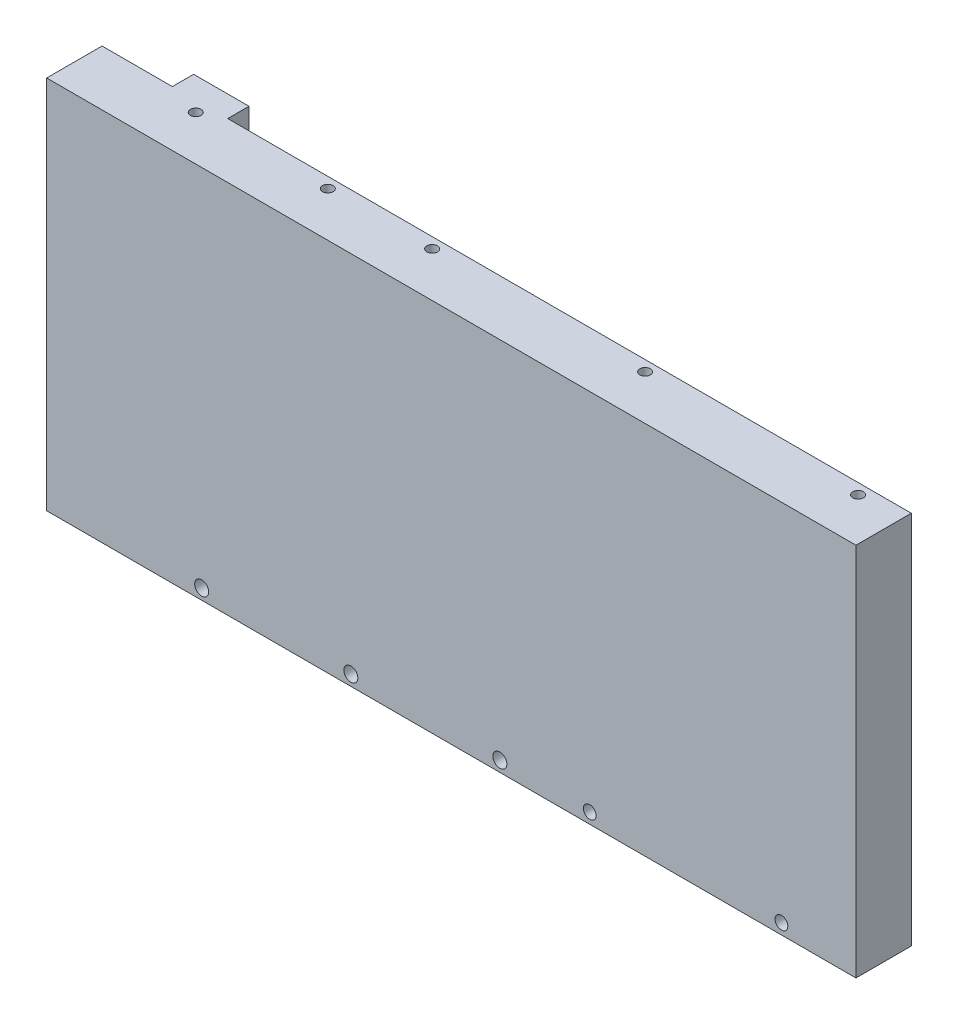
ISO-10303-21;
HEADER;
FILE_DESCRIPTION(('STEP AP214'),'2;1');
FILE_NAME('part.step','',(''),(''),'','','');
FILE_SCHEMA(('AUTOMOTIVE_DESIGN { 1 0 10303 214 1 1 1 1 }'));
ENDSEC;
DATA;
#1=APPLICATION_CONTEXT('core data for automotive mechanical design processes');
#2=APPLICATION_PROTOCOL_DEFINITION('international standard','automotive_design',2000,#1);
#3=PRODUCT_CONTEXT('',#1,'mechanical');
#4=PRODUCT('Part','Part','',(#3));
#5=PRODUCT_RELATED_PRODUCT_CATEGORY('part','',(#4));
#6=PRODUCT_DEFINITION_FORMATION('','',#4);
#7=PRODUCT_DEFINITION_CONTEXT('part definition',#1,'design');
#8=PRODUCT_DEFINITION('design','',#6,#7);
#9=PRODUCT_DEFINITION_SHAPE('','',#8);
#10=(LENGTH_UNIT() NAMED_UNIT(*) SI_UNIT(.MILLI.,.METRE.));
#11=(NAMED_UNIT(*) PLANE_ANGLE_UNIT() SI_UNIT($,.RADIAN.));
#12=(NAMED_UNIT(*) SI_UNIT($,.STERADIAN.) SOLID_ANGLE_UNIT());
#13=UNCERTAINTY_MEASURE_WITH_UNIT(LENGTH_MEASURE(1.E-05),#10,'distance_accuracy_value','');
#14=(GEOMETRIC_REPRESENTATION_CONTEXT(3) GLOBAL_UNCERTAINTY_ASSIGNED_CONTEXT((#13)) GLOBAL_UNIT_ASSIGNED_CONTEXT((#10,
#11,#12)) REPRESENTATION_CONTEXT('',''));
#15=CARTESIAN_POINT('',(0.,0.,0.));
#16=DIRECTION('',(0.,0.,1.));
#17=DIRECTION('',(1.,0.,0.));
#18=AXIS2_PLACEMENT_3D('',#15,#16,#17);
#19=CARTESIAN_POINT('',(0.,0.,0.));
#20=DIRECTION('',(0.,0.,1.));
#21=DIRECTION('',(1.,0.,0.));
#22=AXIS2_PLACEMENT_3D('',#19,#20,#21);
#23=PLANE('',#22);
#24=DIRECTION('',(0.,-1.,0.));
#25=VECTOR('',#24,1.);
#26=CARTESIAN_POINT('',(-43.5,0.,0.));
#27=LINE('',#26,#25);
#28=CARTESIAN_POINT('',(-43.5,29.,0.));
#29=VERTEX_POINT('',#28);
#30=CARTESIAN_POINT('',(-43.5,3.99999999999999,0.));
#31=VERTEX_POINT('',#30);
#32=EDGE_CURVE('E372',#29,#31,#27,.T.);
#33=ORIENTED_EDGE('',*,*,#32,.T.);
#34=CARTESIAN_POINT('',(-36.5,3.99999999999999,0.));
#35=DIRECTION('',(0.,0.,1.));
#36=DIRECTION('',(1.,0.,0.));
#37=AXIS2_PLACEMENT_3D('',#34,#35,#36);
#38=CIRCLE('',#37,6.99999999999999);
#39=CARTESIAN_POINT('',(-29.5,3.99999999999999,0.));
#40=VERTEX_POINT('',#39);
#41=EDGE_CURVE('E11',#31,#40,#38,.T.);
#42=ORIENTED_EDGE('',*,*,#41,.T.);
#43=DIRECTION('',(0.,1.,0.));
#44=VECTOR('',#43,1.);
#45=CARTESIAN_POINT('',(-29.5,0.,0.));
#46=LINE('',#45,#44);
#47=CARTESIAN_POINT('',(-29.5,29.,0.));
#48=VERTEX_POINT('',#47);
#49=EDGE_CURVE('E49',#40,#48,#46,.T.);
#50=ORIENTED_EDGE('',*,*,#49,.T.);
#51=CARTESIAN_POINT('',(-36.5,29.,0.));
#52=DIRECTION('',(0.,0.,1.));
#53=DIRECTION('',(1.,0.,0.));
#54=AXIS2_PLACEMENT_3D('',#51,#52,#53);
#55=CIRCLE('',#54,7.);
#56=EDGE_CURVE('E209',#48,#29,#55,.T.);
#57=ORIENTED_EDGE('',*,*,#56,.T.);
#58=EDGE_LOOP('',(#33,#42,#50,#57));
#59=FACE_BOUND('',#58,.T.);
#60=CARTESIAN_POINT('',(-58.6,-41.5,0.));
#61=DIRECTION('',(0.,0.,1.));
#62=DIRECTION('',(1.,0.,0.));
#63=AXIS2_PLACEMENT_3D('',#60,#61,#62);
#64=CIRCLE('',#63,1.65);
#65=CARTESIAN_POINT('',(-56.95,-41.5,0.));
#66=VERTEX_POINT('',#65);
#67=EDGE_CURVE('E303',#66,#66,#64,.T.);
#68=ORIENTED_EDGE('',*,*,#67,.T.);
#69=EDGE_LOOP('',(#68));
#70=FACE_BOUND('',#69,.T.);
#71=CARTESIAN_POINT('',(-23.6,-41.5,0.));
#72=DIRECTION('',(0.,0.,1.));
#73=DIRECTION('',(1.,0.,0.));
#74=AXIS2_PLACEMENT_3D('',#71,#72,#73);
#75=CIRCLE('',#74,1.65);
#76=CARTESIAN_POINT('',(-21.95,-41.5,0.));
#77=VERTEX_POINT('',#76);
#78=EDGE_CURVE('E310',#77,#77,#75,.T.);
#79=ORIENTED_EDGE('',*,*,#78,.T.);
#80=EDGE_LOOP('',(#79));
#81=FACE_BOUND('',#80,.T.);
#82=CARTESIAN_POINT('',(11.4,-41.5,0.));
#83=DIRECTION('',(0.,0.,1.));
#84=DIRECTION('',(1.,0.,0.));
#85=AXIS2_PLACEMENT_3D('',#82,#83,#84);
#86=CIRCLE('',#85,1.65);
#87=CARTESIAN_POINT('',(13.05,-41.5,0.));
#88=VERTEX_POINT('',#87);
#89=EDGE_CURVE('E316',#88,#88,#86,.T.);
#90=ORIENTED_EDGE('',*,*,#89,.T.);
#91=EDGE_LOOP('',(#90));
#92=FACE_BOUND('',#91,.T.);
#93=CARTESIAN_POINT('',(32.5,-41.5,0.));
#94=DIRECTION('',(0.,0.,1.));
#95=DIRECTION('',(1.,0.,0.));
#96=AXIS2_PLACEMENT_3D('',#93,#94,#95);
#97=CIRCLE('',#96,1.5);
#98=CARTESIAN_POINT('',(34.,-41.5,0.));
#99=VERTEX_POINT('',#98);
#100=EDGE_CURVE('E322',#99,#99,#97,.T.);
#101=ORIENTED_EDGE('',*,*,#100,.T.);
#102=EDGE_LOOP('',(#101));
#103=FACE_BOUND('',#102,.T.);
#104=CARTESIAN_POINT('',(77.5,-41.5,0.));
#105=DIRECTION('',(0.,0.,1.));
#106=DIRECTION('',(1.,0.,0.));
#107=AXIS2_PLACEMENT_3D('',#104,#105,#106);
#108=CIRCLE('',#107,1.5);
#109=CARTESIAN_POINT('',(79.,-41.5,0.));
#110=VERTEX_POINT('',#109);
#111=EDGE_CURVE('E328',#110,#110,#108,.T.);
#112=ORIENTED_EDGE('',*,*,#111,.T.);
#113=EDGE_LOOP('',(#112));
#114=FACE_BOUND('',#113,.T.);
#115=DIRECTION('',(0.,1.,0.));
#116=VECTOR('',#115,1.);
#117=CARTESIAN_POINT('',(14.,-34.,0.));
#118=LINE('',#117,#116);
#119=CARTESIAN_POINT('',(14.,-36.,0.));
#120=VERTEX_POINT('',#119);
#121=CARTESIAN_POINT('',(14.,-34.,0.));
#122=VERTEX_POINT('',#121);
#123=EDGE_CURVE('E256',#120,#122,#118,.T.);
#124=ORIENTED_EDGE('',*,*,#123,.F.);
#125=CARTESIAN_POINT('',(12.,-36.,0.));
#126=DIRECTION('',(0.,0.,1.));
#127=DIRECTION('',(1.,0.,0.));
#128=AXIS2_PLACEMENT_3D('',#125,#126,#127);
#129=CIRCLE('',#128,2.);
#130=CARTESIAN_POINT('',(12.,-38.,0.));
#131=VERTEX_POINT('',#130);
#132=EDGE_CURVE('E367',#120,#131,#129,.F.);
#133=ORIENTED_EDGE('',*,*,#132,.T.);
#134=DIRECTION('',(1.,0.,0.));
#135=VECTOR('',#134,1.);
#136=CARTESIAN_POINT('',(14.,-38.,0.));
#137=LINE('',#136,#135);
#138=CARTESIAN_POINT('',(-65.5,-38.,0.));
#139=VERTEX_POINT('',#138);
#140=EDGE_CURVE('E239',#139,#131,#137,.T.);
#141=ORIENTED_EDGE('',*,*,#140,.F.);
#142=DIRECTION('',(0.,-1.,0.));
#143=VECTOR('',#142,1.);
#144=CARTESIAN_POINT('',(-65.5,44.,0.));
#145=LINE('',#144,#143);
#146=CARTESIAN_POINT('',(-65.5,44.,0.));
#147=VERTEX_POINT('',#146);
#148=EDGE_CURVE('E272',#147,#139,#145,.T.);
#149=ORIENTED_EDGE('',*,*,#148,.F.);
#150=DIRECTION('',(-1.,0.,0.));
#151=VECTOR('',#150,1.);
#152=CARTESIAN_POINT('',(-95.,44.,0.));
#153=LINE('',#152,#151);
#154=CARTESIAN_POINT('',(95.,44.,0.));
#155=VERTEX_POINT('',#154);
#156=EDGE_CURVE('E347',#155,#147,#153,.T.);
#157=ORIENTED_EDGE('',*,*,#156,.F.);
#158=DIRECTION('',(0.,1.,0.));
#159=VECTOR('',#158,1.);
#160=CARTESIAN_POINT('',(95.,44.,0.));
#161=LINE('',#160,#159);
#162=CARTESIAN_POINT('',(95.,-44.,0.));
#163=VERTEX_POINT('',#162);
#164=EDGE_CURVE('E306',#163,#155,#161,.T.);
#165=ORIENTED_EDGE('',*,*,#164,.F.);
#166=DIRECTION('',(1.,0.,0.));
#167=VECTOR('',#166,1.);
#168=CARTESIAN_POINT('',(-95.,-44.,0.));
#169=LINE('',#168,#167);
#170=CARTESIAN_POINT('',(-95.,-44.,0.));
#171=VERTEX_POINT('',#170);
#172=EDGE_CURVE('E337',#171,#163,#169,.T.);
#173=ORIENTED_EDGE('',*,*,#172,.F.);
#174=DIRECTION('',(0.,-1.,0.));
#175=VECTOR('',#174,1.);
#176=CARTESIAN_POINT('',(-95.,44.,0.));
#177=LINE('',#176,#175);
#178=CARTESIAN_POINT('',(-95.,44.,0.));
#179=VERTEX_POINT('',#178);
#180=EDGE_CURVE('E350',#179,#171,#177,.T.);
#181=ORIENTED_EDGE('',*,*,#180,.F.);
#182=CARTESIAN_POINT('',(-78.5,44.,0.));
#183=VERTEX_POINT('',#182);
#184=EDGE_CURVE('E346',#183,#179,#153,.T.);
#185=ORIENTED_EDGE('',*,*,#184,.F.);
#186=DIRECTION('',(0.,1.,0.));
#187=VECTOR('',#186,1.);
#188=CARTESIAN_POINT('',(-78.5,44.,0.));
#189=LINE('',#188,#187);
#190=CARTESIAN_POINT('',(-78.5,-39.,0.));
#191=VERTEX_POINT('',#190);
#192=EDGE_CURVE('E277',#191,#183,#189,.T.);
#193=ORIENTED_EDGE('',*,*,#192,.F.);
#194=DIRECTION('',(-1.,0.,0.));
#195=VECTOR('',#194,1.);
#196=CARTESIAN_POINT('',(-65.5,-39.,0.));
#197=LINE('',#196,#195);
#198=CARTESIAN_POINT('',(15.,-39.,0.));
#199=VERTEX_POINT('',#198);
#200=EDGE_CURVE('E286',#199,#191,#197,.T.);
#201=ORIENTED_EDGE('',*,*,#200,.F.);
#202=DIRECTION('',(0.,-1.,0.));
#203=VECTOR('',#202,1.);
#204=CARTESIAN_POINT('',(15.,-39.,0.));
#205=LINE('',#204,#203);
#206=CARTESIAN_POINT('',(15.,-34.,0.));
#207=VERTEX_POINT('',#206);
#208=EDGE_CURVE('E244',#207,#199,#205,.T.);
#209=ORIENTED_EDGE('',*,*,#208,.F.);
#210=DIRECTION('',(1.,0.,0.));
#211=VECTOR('',#210,1.);
#212=CARTESIAN_POINT('',(15.,-34.,0.));
#213=LINE('',#212,#211);
#214=EDGE_CURVE('E258',#122,#207,#213,.T.);
#215=ORIENTED_EDGE('',*,*,#214,.F.);
#216=EDGE_LOOP('',(#124,#133,#141,#149,#157,#165,#173,#181,#185,#193,#201,#209,#215));
#217=FACE_BOUND('',#216,.T.);
#218=ADVANCED_FACE('F41',(#59,#70,#81,#92,#103,#114,#217),#23,.F.);
#219=CARTESIAN_POINT('',(-65.5,44.,-5.));
#220=DIRECTION('',(-1.,0.,0.));
#221=DIRECTION('',(0.,-1.,0.));
#222=AXIS2_PLACEMENT_3D('',#219,#220,#221);
#223=PLANE('',#222);
#224=DIRECTION('',(0.,0.,1.));
#225=VECTOR('',#224,1.);
#226=CARTESIAN_POINT('',(-65.5,-38.,-1.));
#227=LINE('',#226,#225);
#228=CARTESIAN_POINT('',(-65.5,-38.,-1.));
#229=VERTEX_POINT('',#228);
#230=EDGE_CURVE('E270',#229,#139,#227,.T.);
#231=ORIENTED_EDGE('',*,*,#230,.F.);
#232=DIRECTION('',(0.,1.,0.));
#233=VECTOR('',#232,1.);
#234=CARTESIAN_POINT('',(-65.5,-38.,-1.));
#235=LINE('',#234,#233);
#236=CARTESIAN_POINT('',(-65.5,-39.,-1.));
#237=VERTEX_POINT('',#236);
#238=EDGE_CURVE('E240',#237,#229,#235,.T.);
#239=ORIENTED_EDGE('',*,*,#238,.F.);
#240=DIRECTION('',(0.,0.,1.));
#241=VECTOR('',#240,1.);
#242=CARTESIAN_POINT('',(-65.5,-39.,-5.));
#243=LINE('',#242,#241);
#244=CARTESIAN_POINT('',(-65.5,-39.,-5.));
#245=VERTEX_POINT('',#244);
#246=EDGE_CURVE('E299',#245,#237,#243,.T.);
#247=ORIENTED_EDGE('',*,*,#246,.F.);
#248=DIRECTION('',(0.,-1.,0.));
#249=VECTOR('',#248,1.);
#250=CARTESIAN_POINT('',(-65.5,44.,-5.));
#251=LINE('',#250,#249);
#252=CARTESIAN_POINT('',(-65.5,44.,-5.));
#253=VERTEX_POINT('',#252);
#254=EDGE_CURVE('E273',#253,#245,#251,.T.);
#255=ORIENTED_EDGE('',*,*,#254,.F.);
#256=DIRECTION('',(0.,0.,1.));
#257=VECTOR('',#256,1.);
#258=CARTESIAN_POINT('',(-65.5,44.,-5.));
#259=LINE('',#258,#257);
#260=EDGE_CURVE('E283',#253,#147,#259,.T.);
#261=ORIENTED_EDGE('',*,*,#260,.T.);
#262=ORIENTED_EDGE('',*,*,#148,.T.);
#263=EDGE_LOOP('',(#231,#239,#247,#255,#261,#262));
#264=FACE_BOUND('',#263,.T.);
#265=ADVANCED_FACE('F409',(#264),#223,.F.);
#266=CARTESIAN_POINT('',(95.,44.,13.));
#267=DIRECTION('',(-1.,0.,0.));
#268=DIRECTION('',(0.,-1.,0.));
#269=AXIS2_PLACEMENT_3D('',#266,#267,#268);
#270=PLANE('',#269);
#271=ORIENTED_EDGE('',*,*,#164,.T.);
#272=DIRECTION('',(0.,0.,-1.));
#273=VECTOR('',#272,1.);
#274=CARTESIAN_POINT('',(95.,44.,13.));
#275=LINE('',#274,#273);
#276=CARTESIAN_POINT('',(95.,44.,13.));
#277=VERTEX_POINT('',#276);
#278=EDGE_CURVE('E361',#277,#155,#275,.T.);
#279=ORIENTED_EDGE('',*,*,#278,.F.);
#280=DIRECTION('',(0.,1.,0.));
#281=VECTOR('',#280,1.);
#282=CARTESIAN_POINT('',(95.,44.,13.));
#283=LINE('',#282,#281);
#284=CARTESIAN_POINT('',(95.,-44.,13.));
#285=VERTEX_POINT('',#284);
#286=EDGE_CURVE('E333',#285,#277,#283,.T.);
#287=ORIENTED_EDGE('',*,*,#286,.F.);
#288=DIRECTION('',(0.,0.,-1.));
#289=VECTOR('',#288,1.);
#290=CARTESIAN_POINT('',(95.,-44.,13.));
#291=LINE('',#290,#289);
#292=EDGE_CURVE('E343',#285,#163,#291,.T.);
#293=ORIENTED_EDGE('',*,*,#292,.T.);
#294=EDGE_LOOP('',(#271,#279,#287,#293));
#295=FACE_BOUND('',#294,.T.);
#296=ADVANCED_FACE('F415',(#295),#270,.F.);
#297=CARTESIAN_POINT('',(-95.,44.,13.));
#298=DIRECTION('',(0.,-1.,0.));
#299=DIRECTION('',(1.,0.,0.));
#300=AXIS2_PLACEMENT_3D('',#297,#298,#299);
#301=PLANE('',#300);
#302=CARTESIAN_POINT('',(-70.5,44.,2.50000000000001));
#303=DIRECTION('',(0.,1.,0.));
#304=DIRECTION('',(0.,0.,1.));
#305=AXIS2_PLACEMENT_3D('',#302,#303,#304);
#306=CIRCLE('',#305,1.24999999999999);
#307=CARTESIAN_POINT('',(-70.5,44.,3.74999999999999));
#308=VERTEX_POINT('',#307);
#309=EDGE_CURVE('E212',#308,#308,#306,.T.);
#310=ORIENTED_EDGE('',*,*,#309,.F.);
#311=EDGE_LOOP('',(#310));
#312=FACE_BOUND('',#311,.T.);
#313=CARTESIAN_POINT('',(-39.5,44.,2.50000000000001));
#314=DIRECTION('',(0.,1.,0.));
#315=DIRECTION('',(0.,0.,1.));
#316=AXIS2_PLACEMENT_3D('',#313,#314,#315);
#317=CIRCLE('',#316,1.24999999999999);
#318=CARTESIAN_POINT('',(-39.5,44.,3.74999999999999));
#319=VERTEX_POINT('',#318);
#320=EDGE_CURVE('E218',#319,#319,#317,.T.);
#321=ORIENTED_EDGE('',*,*,#320,.F.);
#322=EDGE_LOOP('',(#321));
#323=FACE_BOUND('',#322,.T.);
#324=CARTESIAN_POINT('',(-15.,44.,2.50000000000001));
#325=DIRECTION('',(0.,1.,0.));
#326=DIRECTION('',(0.,0.,1.));
#327=AXIS2_PLACEMENT_3D('',#324,#325,#326);
#328=CIRCLE('',#327,1.24999999999999);
#329=CARTESIAN_POINT('',(-15.,44.,3.75));
#330=VERTEX_POINT('',#329);
#331=EDGE_CURVE('E221',#330,#330,#328,.T.);
#332=ORIENTED_EDGE('',*,*,#331,.F.);
#333=EDGE_LOOP('',(#332));
#334=FACE_BOUND('',#333,.T.);
#335=CARTESIAN_POINT('',(35.,44.,2.50000000000001));
#336=DIRECTION('',(0.,1.,0.));
#337=DIRECTION('',(0.,0.,1.));
#338=AXIS2_PLACEMENT_3D('',#335,#336,#337);
#339=CIRCLE('',#338,1.24999999999999);
#340=CARTESIAN_POINT('',(35.,44.,3.74999999999999));
#341=VERTEX_POINT('',#340);
#342=EDGE_CURVE('E227',#341,#341,#339,.T.);
#343=ORIENTED_EDGE('',*,*,#342,.F.);
#344=EDGE_LOOP('',(#343));
#345=FACE_BOUND('',#344,.T.);
#346=CARTESIAN_POINT('',(85.,44.,2.50000000000001));
#347=DIRECTION('',(0.,1.,0.));
#348=DIRECTION('',(0.,0.,1.));
#349=AXIS2_PLACEMENT_3D('',#346,#347,#348);
#350=CIRCLE('',#349,1.24999999999999);
#351=CARTESIAN_POINT('',(85.,44.,3.74999999999999));
#352=VERTEX_POINT('',#351);
#353=EDGE_CURVE('E233',#352,#352,#350,.T.);
#354=ORIENTED_EDGE('',*,*,#353,.F.);
#355=EDGE_LOOP('',(#354));
#356=FACE_BOUND('',#355,.T.);
#357=ORIENTED_EDGE('',*,*,#156,.T.);
#358=ORIENTED_EDGE('',*,*,#260,.F.);
#359=DIRECTION('',(1.,0.,0.));
#360=VECTOR('',#359,1.);
#361=CARTESIAN_POINT('',(-65.5,44.,-5.));
#362=LINE('',#361,#360);
#363=CARTESIAN_POINT('',(-78.5,44.,-5.));
#364=VERTEX_POINT('',#363);
#365=EDGE_CURVE('E281',#364,#253,#362,.T.);
#366=ORIENTED_EDGE('',*,*,#365,.F.);
#367=DIRECTION('',(0.,0.,1.));
#368=VECTOR('',#367,1.);
#369=CARTESIAN_POINT('',(-78.5,44.,-5.));
#370=LINE('',#369,#368);
#371=EDGE_CURVE('E293',#364,#183,#370,.T.);
#372=ORIENTED_EDGE('',*,*,#371,.T.);
#373=ORIENTED_EDGE('',*,*,#184,.T.);
#374=DIRECTION('',(0.,0.,-1.));
#375=VECTOR('',#374,1.);
#376=CARTESIAN_POINT('',(-95.,44.,13.));
#377=LINE('',#376,#375);
#378=CARTESIAN_POINT('',(-95.,44.,13.));
#379=VERTEX_POINT('',#378);
#380=EDGE_CURVE('E358',#379,#179,#377,.T.);
#381=ORIENTED_EDGE('',*,*,#380,.F.);
#382=DIRECTION('',(-1.,0.,0.));
#383=VECTOR('',#382,1.);
#384=CARTESIAN_POINT('',(-35.,44.,13.));
#385=LINE('',#384,#383);
#386=EDGE_CURVE('E336',#277,#379,#385,.T.);
#387=ORIENTED_EDGE('',*,*,#386,.F.);
#388=ORIENTED_EDGE('',*,*,#278,.T.);
#389=EDGE_LOOP('',(#357,#358,#366,#372,#373,#381,#387,#388));
#390=FACE_BOUND('',#389,.T.);
#391=ADVANCED_FACE('F430',(#312,#323,#334,#345,#356,#390),#301,.F.);
#392=CARTESIAN_POINT('',(-95.,44.,13.));
#393=DIRECTION('',(1.,0.,0.));
#394=DIRECTION('',(0.,1.,0.));
#395=AXIS2_PLACEMENT_3D('',#392,#393,#394);
#396=PLANE('',#395);
#397=ORIENTED_EDGE('',*,*,#180,.T.);
#398=DIRECTION('',(0.,0.,-1.));
#399=VECTOR('',#398,1.);
#400=CARTESIAN_POINT('',(-95.,-44.,13.));
#401=LINE('',#400,#399);
#402=CARTESIAN_POINT('',(-95.,-44.,13.));
#403=VERTEX_POINT('',#402);
#404=EDGE_CURVE('E355',#403,#171,#401,.T.);
#405=ORIENTED_EDGE('',*,*,#404,.F.);
#406=DIRECTION('',(0.,-1.,0.));
#407=VECTOR('',#406,1.);
#408=CARTESIAN_POINT('',(-95.,44.,13.));
#409=LINE('',#408,#407);
#410=EDGE_CURVE('E339',#379,#403,#409,.T.);
#411=ORIENTED_EDGE('',*,*,#410,.F.);
#412=ORIENTED_EDGE('',*,*,#380,.T.);
#413=EDGE_LOOP('',(#397,#405,#411,#412));
#414=FACE_BOUND('',#413,.T.);
#415=ADVANCED_FACE('F426',(#414),#396,.F.);
#416=CARTESIAN_POINT('',(-95.,-44.,13.));
#417=DIRECTION('',(0.,1.,0.));
#418=DIRECTION('',(-1.,0.,0.));
#419=AXIS2_PLACEMENT_3D('',#416,#417,#418);
#420=PLANE('',#419);
#421=ORIENTED_EDGE('',*,*,#172,.T.);
#422=ORIENTED_EDGE('',*,*,#292,.F.);
#423=DIRECTION('',(1.,0.,0.));
#424=VECTOR('',#423,1.);
#425=CARTESIAN_POINT('',(-95.,-44.,13.));
#426=LINE('',#425,#424);
#427=EDGE_CURVE('E341',#403,#285,#426,.T.);
#428=ORIENTED_EDGE('',*,*,#427,.F.);
#429=ORIENTED_EDGE('',*,*,#404,.T.);
#430=EDGE_LOOP('',(#421,#422,#428,#429));
#431=FACE_BOUND('',#430,.T.);
#432=ADVANCED_FACE('F423',(#431),#420,.F.);
#433=CARTESIAN_POINT('',(0.,0.,13.));
#434=DIRECTION('',(0.,0.,1.));
#435=DIRECTION('',(1.,0.,0.));
#436=AXIS2_PLACEMENT_3D('',#433,#434,#435);
#437=PLANE('',#436);
#438=CARTESIAN_POINT('',(-58.6,-41.5,13.));
#439=DIRECTION('',(0.,0.,1.));
#440=DIRECTION('',(1.,0.,0.));
#441=AXIS2_PLACEMENT_3D('',#438,#439,#440);
#442=CIRCLE('',#441,1.65);
#443=CARTESIAN_POINT('',(-56.95,-41.5,13.));
#444=VERTEX_POINT('',#443);
#445=EDGE_CURVE('E307',#444,#444,#442,.T.);
#446=ORIENTED_EDGE('',*,*,#445,.F.);
#447=EDGE_LOOP('',(#446));
#448=FACE_BOUND('',#447,.T.);
#449=CARTESIAN_POINT('',(-23.6,-41.5,13.));
#450=DIRECTION('',(0.,0.,1.));
#451=DIRECTION('',(1.,0.,0.));
#452=AXIS2_PLACEMENT_3D('',#449,#450,#451);
#453=CIRCLE('',#452,1.65);
#454=CARTESIAN_POINT('',(-21.95,-41.5,13.));
#455=VERTEX_POINT('',#454);
#456=EDGE_CURVE('E313',#455,#455,#453,.T.);
#457=ORIENTED_EDGE('',*,*,#456,.F.);
#458=EDGE_LOOP('',(#457));
#459=FACE_BOUND('',#458,.T.);
#460=CARTESIAN_POINT('',(11.4,-41.5,13.));
#461=DIRECTION('',(0.,0.,1.));
#462=DIRECTION('',(1.,0.,0.));
#463=AXIS2_PLACEMENT_3D('',#460,#461,#462);
#464=CIRCLE('',#463,1.65);
#465=CARTESIAN_POINT('',(13.05,-41.5,13.));
#466=VERTEX_POINT('',#465);
#467=EDGE_CURVE('E319',#466,#466,#464,.T.);
#468=ORIENTED_EDGE('',*,*,#467,.F.);
#469=EDGE_LOOP('',(#468));
#470=FACE_BOUND('',#469,.T.);
#471=CARTESIAN_POINT('',(32.5,-41.5,13.));
#472=DIRECTION('',(0.,0.,1.));
#473=DIRECTION('',(1.,0.,0.));
#474=AXIS2_PLACEMENT_3D('',#471,#472,#473);
#475=CIRCLE('',#474,1.5);
#476=CARTESIAN_POINT('',(34.,-41.5,13.));
#477=VERTEX_POINT('',#476);
#478=EDGE_CURVE('E325',#477,#477,#475,.T.);
#479=ORIENTED_EDGE('',*,*,#478,.F.);
#480=EDGE_LOOP('',(#479));
#481=FACE_BOUND('',#480,.T.);
#482=CARTESIAN_POINT('',(77.5,-41.5,13.));
#483=DIRECTION('',(0.,0.,1.));
#484=DIRECTION('',(1.,0.,0.));
#485=AXIS2_PLACEMENT_3D('',#482,#483,#484);
#486=CIRCLE('',#485,1.5);
#487=CARTESIAN_POINT('',(79.,-41.5,13.));
#488=VERTEX_POINT('',#487);
#489=EDGE_CURVE('E302',#488,#488,#486,.T.);
#490=ORIENTED_EDGE('',*,*,#489,.F.);
#491=EDGE_LOOP('',(#490));
#492=FACE_BOUND('',#491,.T.);
#493=ORIENTED_EDGE('',*,*,#286,.T.);
#494=ORIENTED_EDGE('',*,*,#386,.T.);
#495=ORIENTED_EDGE('',*,*,#410,.T.);
#496=ORIENTED_EDGE('',*,*,#427,.T.);
#497=EDGE_LOOP('',(#493,#494,#495,#496));
#498=FACE_BOUND('',#497,.T.);
#499=ADVANCED_FACE('F421',(#448,#459,#470,#481,#492,#498),#437,.T.);
#500=CARTESIAN_POINT('',(77.5,-41.5,0.));
#501=DIRECTION('',(0.,0.,1.));
#502=DIRECTION('',(1.,0.,0.));
#503=AXIS2_PLACEMENT_3D('',#500,#501,#502);
#504=CYLINDRICAL_SURFACE('',#503,1.5);
#505=ORIENTED_EDGE('',*,*,#111,.F.);
#506=EDGE_LOOP('',(#505));
#507=FACE_BOUND('',#506,.T.);
#508=ORIENTED_EDGE('',*,*,#489,.T.);
#509=EDGE_LOOP('',(#508));
#510=FACE_BOUND('',#509,.T.);
#511=ADVANCED_FACE('F517',(#507,#510),#504,.F.);
#512=CARTESIAN_POINT('',(32.5,-41.5,0.));
#513=DIRECTION('',(0.,0.,1.));
#514=DIRECTION('',(1.,0.,0.));
#515=AXIS2_PLACEMENT_3D('',#512,#513,#514);
#516=CYLINDRICAL_SURFACE('',#515,1.5);
#517=ORIENTED_EDGE('',*,*,#100,.F.);
#518=EDGE_LOOP('',(#517));
#519=FACE_BOUND('',#518,.T.);
#520=ORIENTED_EDGE('',*,*,#478,.T.);
#521=EDGE_LOOP('',(#520));
#522=FACE_BOUND('',#521,.T.);
#523=ADVANCED_FACE('F514',(#519,#522),#516,.F.);
#524=CARTESIAN_POINT('',(11.4,-41.5,0.));
#525=DIRECTION('',(0.,0.,1.));
#526=DIRECTION('',(1.,0.,0.));
#527=AXIS2_PLACEMENT_3D('',#524,#525,#526);
#528=CYLINDRICAL_SURFACE('',#527,1.65);
#529=ORIENTED_EDGE('',*,*,#89,.F.);
#530=EDGE_LOOP('',(#529));
#531=FACE_BOUND('',#530,.T.);
#532=ORIENTED_EDGE('',*,*,#467,.T.);
#533=EDGE_LOOP('',(#532));
#534=FACE_BOUND('',#533,.T.);
#535=ADVANCED_FACE('F510',(#531,#534),#528,.F.);
#536=CARTESIAN_POINT('',(-23.6,-41.5,0.));
#537=DIRECTION('',(0.,0.,1.));
#538=DIRECTION('',(1.,0.,0.));
#539=AXIS2_PLACEMENT_3D('',#536,#537,#538);
#540=CYLINDRICAL_SURFACE('',#539,1.65);
#541=ORIENTED_EDGE('',*,*,#78,.F.);
#542=EDGE_LOOP('',(#541));
#543=FACE_BOUND('',#542,.T.);
#544=ORIENTED_EDGE('',*,*,#456,.T.);
#545=EDGE_LOOP('',(#544));
#546=FACE_BOUND('',#545,.T.);
#547=ADVANCED_FACE('F506',(#543,#546),#540,.F.);
#548=CARTESIAN_POINT('',(-58.6,-41.5,0.));
#549=DIRECTION('',(0.,0.,1.));
#550=DIRECTION('',(1.,0.,0.));
#551=AXIS2_PLACEMENT_3D('',#548,#549,#550);
#552=CYLINDRICAL_SURFACE('',#551,1.65);
#553=ORIENTED_EDGE('',*,*,#67,.F.);
#554=EDGE_LOOP('',(#553));
#555=FACE_BOUND('',#554,.T.);
#556=ORIENTED_EDGE('',*,*,#445,.T.);
#557=EDGE_LOOP('',(#556));
#558=FACE_BOUND('',#557,.T.);
#559=ADVANCED_FACE('F502',(#555,#558),#552,.F.);
#560=CARTESIAN_POINT('',(-65.5,-39.,-5.));
#561=DIRECTION('',(0.,1.,0.));
#562=DIRECTION('',(-1.,0.,0.));
#563=AXIS2_PLACEMENT_3D('',#560,#561,#562);
#564=PLANE('',#563);
#565=ORIENTED_EDGE('',*,*,#200,.T.);
#566=DIRECTION('',(0.,0.,1.));
#567=VECTOR('',#566,1.);
#568=CARTESIAN_POINT('',(-78.5,-39.,-5.));
#569=LINE('',#568,#567);
#570=CARTESIAN_POINT('',(-78.5,-39.,-5.));
#571=VERTEX_POINT('',#570);
#572=EDGE_CURVE('E296',#571,#191,#569,.T.);
#573=ORIENTED_EDGE('',*,*,#572,.F.);
#574=DIRECTION('',(-1.,0.,0.));
#575=VECTOR('',#574,1.);
#576=CARTESIAN_POINT('',(-65.5,-39.,-5.));
#577=LINE('',#576,#575);
#578=EDGE_CURVE('E276',#245,#571,#577,.T.);
#579=ORIENTED_EDGE('',*,*,#578,.F.);
#580=ORIENTED_EDGE('',*,*,#246,.T.);
#581=DIRECTION('',(-1.,0.,0.));
#582=VECTOR('',#581,1.);
#583=CARTESIAN_POINT('',(-65.5,-39.,-1.));
#584=LINE('',#583,#582);
#585=CARTESIAN_POINT('',(15.,-39.,-1.));
#586=VERTEX_POINT('',#585);
#587=EDGE_CURVE('E252',#586,#237,#584,.T.);
#588=ORIENTED_EDGE('',*,*,#587,.F.);
#589=DIRECTION('',(0.,0.,1.));
#590=VECTOR('',#589,1.);
#591=CARTESIAN_POINT('',(15.,-39.,-1.));
#592=LINE('',#591,#590);
#593=EDGE_CURVE('E254',#586,#199,#592,.T.);
#594=ORIENTED_EDGE('',*,*,#593,.T.);
#595=EDGE_LOOP('',(#565,#573,#579,#580,#588,#594));
#596=FACE_BOUND('',#595,.T.);
#597=ADVANCED_FACE('F465',(#596),#564,.F.);
#598=CARTESIAN_POINT('',(-78.5,44.,-5.));
#599=DIRECTION('',(1.,0.,0.));
#600=DIRECTION('',(0.,1.,0.));
#601=AXIS2_PLACEMENT_3D('',#598,#599,#600);
#602=PLANE('',#601);
#603=ORIENTED_EDGE('',*,*,#192,.T.);
#604=ORIENTED_EDGE('',*,*,#371,.F.);
#605=DIRECTION('',(0.,1.,0.));
#606=VECTOR('',#605,1.);
#607=CARTESIAN_POINT('',(-78.5,44.,-5.));
#608=LINE('',#607,#606);
#609=EDGE_CURVE('E279',#571,#364,#608,.T.);
#610=ORIENTED_EDGE('',*,*,#609,.F.);
#611=ORIENTED_EDGE('',*,*,#572,.T.);
#612=EDGE_LOOP('',(#603,#604,#610,#611));
#613=FACE_BOUND('',#612,.T.);
#614=ADVANCED_FACE('F456',(#613),#602,.F.);
#615=CARTESIAN_POINT('',(0.,0.,-5.));
#616=DIRECTION('',(0.,0.,-1.));
#617=DIRECTION('',(-1.,0.,0.));
#618=AXIS2_PLACEMENT_3D('',#615,#616,#617);
#619=PLANE('',#618);
#620=ORIENTED_EDGE('',*,*,#254,.T.);
#621=ORIENTED_EDGE('',*,*,#578,.T.);
#622=ORIENTED_EDGE('',*,*,#609,.T.);
#623=ORIENTED_EDGE('',*,*,#365,.T.);
#624=EDGE_LOOP('',(#620,#621,#622,#623));
#625=FACE_BOUND('',#624,.T.);
#626=ADVANCED_FACE('F462',(#625),#619,.T.);
#627=CARTESIAN_POINT('',(14.,-38.,-1.));
#628=DIRECTION('',(0.,-1.,0.));
#629=DIRECTION('',(0.,0.,-1.));
#630=AXIS2_PLACEMENT_3D('',#627,#628,#629);
#631=PLANE('',#630);
#632=ORIENTED_EDGE('',*,*,#140,.T.);
#633=DIRECTION('',(0.,0.,1.));
#634=VECTOR('',#633,1.);
#635=CARTESIAN_POINT('',(12.,-38.,-1.));
#636=LINE('',#635,#634);
#637=CARTESIAN_POINT('',(12.,-38.,-1.));
#638=VERTEX_POINT('',#637);
#639=EDGE_CURVE('E64',#131,#638,#636,.F.);
#640=ORIENTED_EDGE('',*,*,#639,.T.);
#641=DIRECTION('',(1.,0.,0.));
#642=VECTOR('',#641,1.);
#643=CARTESIAN_POINT('',(14.,-38.,-1.));
#644=LINE('',#643,#642);
#645=EDGE_CURVE('E243',#229,#638,#644,.T.);
#646=ORIENTED_EDGE('',*,*,#645,.F.);
#647=ORIENTED_EDGE('',*,*,#230,.T.);
#648=EDGE_LOOP('',(#632,#640,#646,#647));
#649=FACE_BOUND('',#648,.T.);
#650=ADVANCED_FACE('F488',(#649),#631,.F.);
#651=CARTESIAN_POINT('',(14.,-34.,-1.));
#652=DIRECTION('',(1.,0.,0.));
#653=DIRECTION('',(0.,0.,-1.));
#654=AXIS2_PLACEMENT_3D('',#651,#652,#653);
#655=PLANE('',#654);
#656=DIRECTION('',(0.,1.,0.));
#657=VECTOR('',#656,1.);
#658=CARTESIAN_POINT('',(14.,-34.,-1.));
#659=LINE('',#658,#657);
#660=CARTESIAN_POINT('',(14.,-36.,-1.));
#661=VERTEX_POINT('',#660);
#662=CARTESIAN_POINT('',(14.,-34.,-1.));
#663=VERTEX_POINT('',#662);
#664=EDGE_CURVE('E246',#661,#663,#659,.T.);
#665=ORIENTED_EDGE('',*,*,#664,.F.);
#666=DIRECTION('',(0.,0.,1.));
#667=VECTOR('',#666,1.);
#668=CARTESIAN_POINT('',(14.,-36.,0.));
#669=LINE('',#668,#667);
#670=EDGE_CURVE('E364',#661,#120,#669,.T.);
#671=ORIENTED_EDGE('',*,*,#670,.T.);
#672=ORIENTED_EDGE('',*,*,#123,.T.);
#673=DIRECTION('',(0.,0.,1.));
#674=VECTOR('',#673,1.);
#675=CARTESIAN_POINT('',(14.,-34.,-1.));
#676=LINE('',#675,#674);
#677=EDGE_CURVE('E267',#663,#122,#676,.T.);
#678=ORIENTED_EDGE('',*,*,#677,.F.);
#679=EDGE_LOOP('',(#665,#671,#672,#678));
#680=FACE_BOUND('',#679,.T.);
#681=ADVANCED_FACE('F480',(#680),#655,.F.);
#682=CARTESIAN_POINT('',(15.,-34.,-1.));
#683=DIRECTION('',(0.,-1.,0.));
#684=DIRECTION('',(1.,0.,0.));
#685=AXIS2_PLACEMENT_3D('',#682,#683,#684);
#686=PLANE('',#685);
#687=ORIENTED_EDGE('',*,*,#214,.T.);
#688=DIRECTION('',(0.,0.,1.));
#689=VECTOR('',#688,1.);
#690=CARTESIAN_POINT('',(15.,-34.,-1.));
#691=LINE('',#690,#689);
#692=CARTESIAN_POINT('',(15.,-34.,-1.));
#693=VERTEX_POINT('',#692);
#694=EDGE_CURVE('E264',#693,#207,#691,.T.);
#695=ORIENTED_EDGE('',*,*,#694,.F.);
#696=DIRECTION('',(1.,0.,0.));
#697=VECTOR('',#696,1.);
#698=CARTESIAN_POINT('',(15.,-34.,-1.));
#699=LINE('',#698,#697);
#700=EDGE_CURVE('E248',#663,#693,#699,.T.);
#701=ORIENTED_EDGE('',*,*,#700,.F.);
#702=ORIENTED_EDGE('',*,*,#677,.T.);
#703=EDGE_LOOP('',(#687,#695,#701,#702));
#704=FACE_BOUND('',#703,.T.);
#705=ADVANCED_FACE('F476',(#704),#686,.F.);
#706=CARTESIAN_POINT('',(15.,-39.,-1.));
#707=DIRECTION('',(-1.,0.,0.));
#708=DIRECTION('',(0.,0.,1.));
#709=AXIS2_PLACEMENT_3D('',#706,#707,#708);
#710=PLANE('',#709);
#711=ORIENTED_EDGE('',*,*,#208,.T.);
#712=ORIENTED_EDGE('',*,*,#593,.F.);
#713=DIRECTION('',(0.,-1.,0.));
#714=VECTOR('',#713,1.);
#715=CARTESIAN_POINT('',(15.,-39.,-1.));
#716=LINE('',#715,#714);
#717=EDGE_CURVE('E250',#693,#586,#716,.T.);
#718=ORIENTED_EDGE('',*,*,#717,.F.);
#719=ORIENTED_EDGE('',*,*,#694,.T.);
#720=EDGE_LOOP('',(#711,#712,#718,#719));
#721=FACE_BOUND('',#720,.T.);
#722=ADVANCED_FACE('F471',(#721),#710,.F.);
#723=CARTESIAN_POINT('',(0.,0.,-1.));
#724=DIRECTION('',(0.,0.,1.));
#725=DIRECTION('',(1.,0.,0.));
#726=AXIS2_PLACEMENT_3D('',#723,#724,#725);
#727=PLANE('',#726);
#728=ORIENTED_EDGE('',*,*,#238,.T.);
#729=ORIENTED_EDGE('',*,*,#645,.T.);
#730=CARTESIAN_POINT('',(12.,-36.,-1.));
#731=DIRECTION('',(0.,0.,1.));
#732=DIRECTION('',(1.,0.,0.));
#733=AXIS2_PLACEMENT_3D('',#730,#731,#732);
#734=CIRCLE('',#733,2.);
#735=EDGE_CURVE('E370',#638,#661,#734,.T.);
#736=ORIENTED_EDGE('',*,*,#735,.T.);
#737=ORIENTED_EDGE('',*,*,#664,.T.);
#738=ORIENTED_EDGE('',*,*,#700,.T.);
#739=ORIENTED_EDGE('',*,*,#717,.T.);
#740=ORIENTED_EDGE('',*,*,#587,.T.);
#741=EDGE_LOOP('',(#728,#729,#736,#737,#738,#739,#740));
#742=FACE_BOUND('',#741,.T.);
#743=ADVANCED_FACE('F485',(#742),#727,.F.);
#744=CARTESIAN_POINT('',(12.,-36.,-1.));
#745=DIRECTION('',(0.,0.,-1.));
#746=DIRECTION('',(-1.,0.,0.));
#747=AXIS2_PLACEMENT_3D('',#744,#745,#746);
#748=CYLINDRICAL_SURFACE('',#747,2.);
#749=ORIENTED_EDGE('',*,*,#735,.F.);
#750=ORIENTED_EDGE('',*,*,#639,.F.);
#751=ORIENTED_EDGE('',*,*,#132,.F.);
#752=ORIENTED_EDGE('',*,*,#670,.F.);
#753=EDGE_LOOP('',(#749,#750,#751,#752));
#754=FACE_BOUND('',#753,.T.);
#755=ADVANCED_FACE('F43',(#754),#748,.F.);
#756=CARTESIAN_POINT('',(85.,32.,2.50000000000001));
#757=DIRECTION('',(0.,1.,0.));
#758=DIRECTION('',(0.,0.,1.));
#759=AXIS2_PLACEMENT_3D('',#756,#757,#758);
#760=CONICAL_SURFACE('',#759,1.25,1.02974425867666);
#761=CARTESIAN_POINT('',(85.,31.2489242262155,2.50000000000001));
#762=VERTEX_POINT('',#761);
#763=VERTEX_LOOP('',#762);
#764=FACE_BOUND('',#763,.T.);
#765=CARTESIAN_POINT('',(85.,32.,2.50000000000001));
#766=DIRECTION('',(0.,1.,0.));
#767=DIRECTION('',(0.,0.,1.));
#768=AXIS2_PLACEMENT_3D('',#765,#766,#767);
#769=CIRCLE('',#768,1.25);
#770=CARTESIAN_POINT('',(85.,32.,3.75000000000001));
#771=VERTEX_POINT('',#770);
#772=EDGE_CURVE('E236',#771,#771,#769,.T.);
#773=ORIENTED_EDGE('',*,*,#772,.T.);
#774=EDGE_LOOP('',(#773));
#775=FACE_BOUND('',#774,.T.);
#776=ADVANCED_FACE('F568',(#764,#775),#760,.F.);
#777=CARTESIAN_POINT('',(85.,44.,2.50000000000001));
#778=DIRECTION('',(0.,1.,0.));
#779=DIRECTION('',(0.,0.,1.));
#780=AXIS2_PLACEMENT_3D('',#777,#778,#779);
#781=CYLINDRICAL_SURFACE('',#780,1.24999999999999);
#782=ORIENTED_EDGE('',*,*,#772,.F.);
#783=EDGE_LOOP('',(#782));
#784=FACE_BOUND('',#783,.T.);
#785=ORIENTED_EDGE('',*,*,#353,.T.);
#786=EDGE_LOOP('',(#785));
#787=FACE_BOUND('',#786,.T.);
#788=ADVANCED_FACE('F573',(#784,#787),#781,.F.);
#789=CARTESIAN_POINT('',(35.,32.,2.50000000000001));
#790=DIRECTION('',(0.,1.,0.));
#791=DIRECTION('',(0.,0.,1.));
#792=AXIS2_PLACEMENT_3D('',#789,#790,#791);
#793=CONICAL_SURFACE('',#792,1.24999999999999,1.02974425867665);
#794=CARTESIAN_POINT('',(35.,31.2489242262155,2.50000000000001));
#795=VERTEX_POINT('',#794);
#796=VERTEX_LOOP('',#795);
#797=FACE_BOUND('',#796,.T.);
#798=CARTESIAN_POINT('',(35.,32.,2.50000000000001));
#799=DIRECTION('',(0.,1.,0.));
#800=DIRECTION('',(0.,0.,1.));
#801=AXIS2_PLACEMENT_3D('',#798,#799,#800);
#802=CIRCLE('',#801,1.24999999999999);
#803=CARTESIAN_POINT('',(35.,32.,3.75));
#804=VERTEX_POINT('',#803);
#805=EDGE_CURVE('E230',#804,#804,#802,.T.);
#806=ORIENTED_EDGE('',*,*,#805,.T.);
#807=EDGE_LOOP('',(#806));
#808=FACE_BOUND('',#807,.T.);
#809=ADVANCED_FACE('F584',(#797,#808),#793,.F.);
#810=CARTESIAN_POINT('',(35.,44.,2.50000000000001));
#811=DIRECTION('',(0.,1.,0.));
#812=DIRECTION('',(0.,0.,1.));
#813=AXIS2_PLACEMENT_3D('',#810,#811,#812);
#814=CYLINDRICAL_SURFACE('',#813,1.24999999999999);
#815=ORIENTED_EDGE('',*,*,#805,.F.);
#816=EDGE_LOOP('',(#815));
#817=FACE_BOUND('',#816,.T.);
#818=ORIENTED_EDGE('',*,*,#342,.T.);
#819=EDGE_LOOP('',(#818));
#820=FACE_BOUND('',#819,.T.);
#821=ADVANCED_FACE('F597',(#817,#820),#814,.F.);
#822=CARTESIAN_POINT('',(-15.,32.,2.50000000000001));
#823=DIRECTION('',(0.,1.,0.));
#824=DIRECTION('',(0.,0.,1.));
#825=AXIS2_PLACEMENT_3D('',#822,#823,#824);
#826=CONICAL_SURFACE('',#825,1.25,1.02974425867665);
#827=CARTESIAN_POINT('',(-15.,31.2489242262155,2.50000000000001));
#828=VERTEX_POINT('',#827);
#829=VERTEX_LOOP('',#828);
#830=FACE_BOUND('',#829,.T.);
#831=CARTESIAN_POINT('',(-15.,32.,2.50000000000001));
#832=DIRECTION('',(0.,1.,0.));
#833=DIRECTION('',(0.,0.,1.));
#834=AXIS2_PLACEMENT_3D('',#831,#832,#833);
#835=CIRCLE('',#834,1.25);
#836=CARTESIAN_POINT('',(-15.,32.,3.75));
#837=VERTEX_POINT('',#836);
#838=EDGE_CURVE('E224',#837,#837,#835,.T.);
#839=ORIENTED_EDGE('',*,*,#838,.T.);
#840=EDGE_LOOP('',(#839));
#841=FACE_BOUND('',#840,.T.);
#842=ADVANCED_FACE('F607',(#830,#841),#826,.F.);
#843=CARTESIAN_POINT('',(-15.,44.,2.50000000000001));
#844=DIRECTION('',(0.,1.,0.));
#845=DIRECTION('',(0.,0.,1.));
#846=AXIS2_PLACEMENT_3D('',#843,#844,#845);
#847=CYLINDRICAL_SURFACE('',#846,1.24999999999999);
#848=ORIENTED_EDGE('',*,*,#838,.F.);
#849=EDGE_LOOP('',(#848));
#850=FACE_BOUND('',#849,.T.);
#851=ORIENTED_EDGE('',*,*,#331,.T.);
#852=EDGE_LOOP('',(#851));
#853=FACE_BOUND('',#852,.T.);
#854=ADVANCED_FACE('F405',(#850,#853),#847,.F.);
#855=CARTESIAN_POINT('',(-39.5,44.,2.50000000000001));
#856=DIRECTION('',(0.,1.,0.));
#857=DIRECTION('',(0.,0.,1.));
#858=AXIS2_PLACEMENT_3D('',#855,#856,#857);
#859=CYLINDRICAL_SURFACE('',#858,1.24999999999999);
#860=CARTESIAN_POINT('',(-39.5,35.3245553203368,3.75));
#861=CARTESIAN_POINT('',(-39.5794479147214,35.2868675864246,3.74999805960137));
#862=CARTESIAN_POINT('',(-39.6582116424317,35.2476556232665,3.74241353686633));
#863=CARTESIAN_POINT('',(-39.8121171740763,35.1674498962852,3.7129460777175));
#864=CARTESIAN_POINT('',(-39.8872547815027,35.1264541676887,3.69104698190263));
#865=CARTESIAN_POINT('',(-40.0319031598627,35.0442176876674,3.63385058511951));
#866=CARTESIAN_POINT('',(-40.1014236780915,35.0029775000573,3.59857712588742));
#867=CARTESIAN_POINT('',(-40.2333426848121,34.9218370658083,3.51528161129218));
#868=CARTESIAN_POINT('',(-40.2957371219515,34.8819375904048,3.46725235503171));
#869=CARTESIAN_POINT('',(-40.4120494859962,34.8052359765969,3.35852570475437));
#870=CARTESIAN_POINT('',(-40.4658843271969,34.7684656394296,3.29771604859045));
#871=CARTESIAN_POINT('',(-40.5618902066903,34.7012700168266,3.16451875566749));
#872=CARTESIAN_POINT('',(-40.6040914388588,34.6708283574611,3.09216187508813));
#873=CARTESIAN_POINT('',(-40.6626851126042,34.627870278377,2.96257146467561));
#874=CARTESIAN_POINT('',(-40.6830124739636,34.6127381441158,2.90796858330233));
#875=CARTESIAN_POINT('',(-40.7160279822449,34.5879814493772,2.79531294593901));
#876=CARTESIAN_POINT('',(-40.728723799227,34.5783513595711,2.73726371839822));
#877=CARTESIAN_POINT('',(-40.7457645205799,34.5653934223963,2.61897722778796));
#878=CARTESIAN_POINT('',(-40.7500723452843,34.5620935591528,2.55873144339278));
#879=CARTESIAN_POINT('',(-40.7499258354926,34.5622055615464,2.43825257955968));
#880=CARTESIAN_POINT('',(-40.7454715181912,34.5656174140127,2.37801950009706));
#881=CARTESIAN_POINT('',(-40.7287035018313,34.578365679611,2.26354841752577));
#882=CARTESIAN_POINT('',(-40.7169411407059,34.58728623613,2.20918031897827));
#883=CARTESIAN_POINT('',(-40.6866998442723,34.6099821001999,2.10342604083887));
#884=CARTESIAN_POINT('',(-40.6682192560892,34.6237586024262,2.05204059867633));
#885=CARTESIAN_POINT('',(-40.6237043746803,34.6564898858063,1.94940903350871));
#886=CARTESIAN_POINT('',(-40.5972051609907,34.6757570713042,1.89846627215452));
#887=CARTESIAN_POINT('',(-40.53831896258,34.7178045858302,1.80171192384219));
#888=CARTESIAN_POINT('',(-40.5059289928215,34.7405866950925,1.75590295745271));
#889=CARTESIAN_POINT('',(-40.4298417069096,34.7929990122173,1.66204435057895));
#890=CARTESIAN_POINT('',(-40.3851583906839,34.823124180699,1.61507091166554));
#891=CARTESIAN_POINT('',(-40.2899666698971,34.885524559228,1.52913921904118));
#892=CARTESIAN_POINT('',(-40.2394542143266,34.9178012578393,1.49018659244543));
#893=CARTESIAN_POINT('',(-40.1243775284541,34.9890915013042,1.41456087358945));
#894=CARTESIAN_POINT('',(-40.0588965884261,35.0283013459351,1.37945917210966));
#895=CARTESIAN_POINT('',(-39.9227146004228,35.1066525153886,1.32131498474181));
#896=CARTESIAN_POINT('',(-39.8520108060579,35.1457937929216,1.29827889569704));
#897=CARTESIAN_POINT('',(-39.7018472152965,35.225421826449,1.26383931810058));
#898=CARTESIAN_POINT('',(-39.6221206341521,35.2658121238608,1.25335884578662));
#899=CARTESIAN_POINT('',(-39.4607138463525,35.3436733806179,1.24801384010171));
#900=CARTESIAN_POINT('',(-39.3790341671976,35.3811451168356,1.25314513646802));
#901=CARTESIAN_POINT('',(-39.2206887239824,35.4501885425391,1.27910365191306));
#902=CARTESIAN_POINT('',(-39.1439799270806,35.4819638128069,1.29911591964539));
#903=CARTESIAN_POINT('',(-38.9942779297311,35.5410276335783,1.35409893921219));
#904=CARTESIAN_POINT('',(-38.9212821388346,35.5683193426063,1.38905909764745));
#905=CARTESIAN_POINT('',(-38.7890456249666,35.6154911939556,1.46925756014495));
#906=CARTESIAN_POINT('',(-38.7291577958238,35.6358349307692,1.51315805281997));
#907=CARTESIAN_POINT('',(-38.6174471640701,35.6723214153792,1.6116659958469));
#908=CARTESIAN_POINT('',(-38.565620781912,35.6884660298767,1.66626866959665));
#909=CARTESIAN_POINT('',(-38.4755915314032,35.7155861090052,1.78029017110199));
#910=CARTESIAN_POINT('',(-38.4366768092192,35.7268498873914,1.83907993888045));
#911=CARTESIAN_POINT('',(-38.3691234649315,35.7459332059867,1.96280171784874));
#912=CARTESIAN_POINT('',(-38.3404827233995,35.7537534566399,2.02773245871552));
#913=CARTESIAN_POINT('',(-38.2952845527096,35.7659061798842,2.15961220705943));
#914=CARTESIAN_POINT('',(-38.2783670750047,35.7703430434535,2.22642850251409));
#915=CARTESIAN_POINT('',(-38.2557339603831,35.7762480361955,2.36205929050114));
#916=CARTESIAN_POINT('',(-38.2500175267908,35.7777163765049,2.43087364056833));
#917=CARTESIAN_POINT('',(-38.249982723295,35.7777252711023,2.56782470629759));
#918=CARTESIAN_POINT('',(-38.2555527388738,35.7762944954749,2.6359614262278));
#919=CARTESIAN_POINT('',(-38.2776775413901,35.7705237211351,2.77029852727432));
#920=CARTESIAN_POINT('',(-38.2942320038467,35.7661838083587,2.83649896552816));
#921=CARTESIAN_POINT('',(-38.3377563302335,35.7544914981328,2.96507495529304));
#922=CARTESIAN_POINT('',(-38.36472295761,35.7471400367603,3.02745168840304));
#923=CARTESIAN_POINT('',(-38.4281472623268,35.7292888486734,3.14667698169815));
#924=CARTESIAN_POINT('',(-38.4646047313951,35.7187891910439,3.20352566315613));
#925=CARTESIAN_POINT('',(-38.5461013357029,35.6944220898944,3.31064406208346));
#926=CARTESIAN_POINT('',(-38.591209323191,35.6805273626324,3.3608551295812));
#927=CARTESIAN_POINT('',(-38.6882630771017,35.6493682100342,3.45292125661745));
#928=CARTESIAN_POINT('',(-38.7402098026002,35.6321033118953,3.49477514205484));
#929=CARTESIAN_POINT('',(-38.8506887760451,35.5937672586316,3.5702760253597));
#930=CARTESIAN_POINT('',(-38.9093599105651,35.5726067197637,3.60367382799499));
#931=CARTESIAN_POINT('',(-39.0302133430452,35.5270351103212,3.66028180675656));
#932=CARTESIAN_POINT('',(-39.0923951384253,35.5026245043443,3.68349343696475));
#933=CARTESIAN_POINT('',(-39.2122127144222,35.4535007086246,3.71785445973727));
#934=CARTESIAN_POINT('',(-39.2696859480236,35.4290588092233,3.7299735398232));
#935=CARTESIAN_POINT('',(-39.3848916873469,35.3781950638537,3.74604814658228));
#936=CARTESIAN_POINT('',(-39.4426242607473,35.3517726689802,3.75000140131816));
#937=CARTESIAN_POINT('',(-39.5,35.3245553203368,3.75));
#938=B_SPLINE_CURVE_WITH_KNOTS('',3,(#860,#861,#862,#863,#864,#865,#866,#867,#868,#869,#870,
#871,#872,#873,#874,#875,#876,#877,#878,#879,#880,#881,#882,#883,#884,#885,#886,#887,#888,#889,
#890,#891,#892,#893,#894,#895,#896,#897,#898,#899,#900,#901,#902,#903,#904,#905,#906,#907,#908,
#909,#910,#911,#912,#913,#914,#915,#916,#917,#918,#919,#920,#921,#922,#923,#924,#925,#926,#927,
#928,#929,#930,#931,#932,#933,#934,#935,#936,#937),.UNSPECIFIED.,.T.,.F.,(4,2,2,2,2,2,2,2,2,2,2,
2,2,2,2,2,2,2,2,2,2,2,2,2,2,2,2,2,2,2,2,2,2,2,2,2,2,2,4),(0.,0.2635601720258,0.527418386259491,
0.790808429827751,1.05434747945632,1.3203061794134,1.58556796812206,1.76543133608804,
1.94511362936308,2.12558843264249,2.30606288176259,2.47434390073006,2.64266634966897,
2.82369571961456,3.00481707991865,3.21848064355628,3.43229359899388,3.68324815127277,
3.93433561815932,4.20292916885291,4.47145097832725,4.7262597529843,4.98088824610726,
5.2106405517988,5.44029054689059,5.65341957266165,5.86650460654476,6.07271452778302,
6.27890978178268,6.48307587225839,6.68723593192858,6.89133258079769,7.09542475124001,
7.30121436611852,7.50703287208475,7.71835134640542,7.92963964507274,8.11992474177645,
8.31026277343611),.UNSPECIFIED.);
#939=CARTESIAN_POINT('',(-39.5,35.3245553203368,3.75));
#940=VERTEX_POINT('',#939);
#941=EDGE_CURVE('E204',#940,#940,#938,.T.);
#942=ORIENTED_EDGE('',*,*,#941,.T.);
#943=EDGE_LOOP('',(#942));
#944=FACE_BOUND('',#943,.T.);
#945=ORIENTED_EDGE('',*,*,#320,.T.);
#946=EDGE_LOOP('',(#945));
#947=FACE_BOUND('',#946,.T.);
#948=ADVANCED_FACE('F380',(#944,#947),#859,.F.);
#949=CARTESIAN_POINT('',(-70.5,32.,2.50000000000001));
#950=DIRECTION('',(0.,1.,0.));
#951=DIRECTION('',(0.,0.,1.));
#952=AXIS2_PLACEMENT_3D('',#949,#950,#951);
#953=CONICAL_SURFACE('',#952,1.25,1.02974425867666);
#954=CARTESIAN_POINT('',(-70.5,31.2489242262155,2.50000000000001));
#955=VERTEX_POINT('',#954);
#956=VERTEX_LOOP('',#955);
#957=FACE_BOUND('',#956,.T.);
#958=CARTESIAN_POINT('',(-70.5,32.,2.50000000000001));
#959=DIRECTION('',(0.,1.,0.));
#960=DIRECTION('',(0.,0.,1.));
#961=AXIS2_PLACEMENT_3D('',#958,#959,#960);
#962=CIRCLE('',#961,1.25);
#963=CARTESIAN_POINT('',(-70.5,32.,3.75000000000001));
#964=VERTEX_POINT('',#963);
#965=EDGE_CURVE('E215',#964,#964,#962,.T.);
#966=ORIENTED_EDGE('',*,*,#965,.T.);
#967=EDGE_LOOP('',(#966));
#968=FACE_BOUND('',#967,.T.);
#969=ADVANCED_FACE('F398',(#957,#968),#953,.F.);
#970=CARTESIAN_POINT('',(-70.5,44.,2.50000000000001));
#971=DIRECTION('',(0.,1.,0.));
#972=DIRECTION('',(0.,0.,1.));
#973=AXIS2_PLACEMENT_3D('',#970,#971,#972);
#974=CYLINDRICAL_SURFACE('',#973,1.24999999999999);
#975=ORIENTED_EDGE('',*,*,#965,.F.);
#976=EDGE_LOOP('',(#975));
#977=FACE_BOUND('',#976,.T.);
#978=ORIENTED_EDGE('',*,*,#309,.T.);
#979=EDGE_LOOP('',(#978));
#980=FACE_BOUND('',#979,.T.);
#981=ADVANCED_FACE('F396',(#977,#980),#974,.F.);
#982=CARTESIAN_POINT('',(-36.5,3.99999999999999,12.));
#983=DIRECTION('',(0.,0.,-1.));
#984=DIRECTION('',(-1.,0.,0.));
#985=AXIS2_PLACEMENT_3D('',#982,#983,#984);
#986=CYLINDRICAL_SURFACE('',#985,6.99999999999999);
#987=DIRECTION('',(0.,0.,-1.));
#988=VECTOR('',#987,1.);
#989=CARTESIAN_POINT('',(-43.5,3.99999999999999,12.));
#990=LINE('',#989,#988);
#991=CARTESIAN_POINT('',(-43.5,3.99999999999999,12.));
#992=VERTEX_POINT('',#991);
#993=EDGE_CURVE('E56',#992,#31,#990,.T.);
#994=ORIENTED_EDGE('',*,*,#993,.F.);
#995=CARTESIAN_POINT('',(-36.5,3.99999999999999,12.));
#996=DIRECTION('',(0.,0.,-1.));
#997=DIRECTION('',(-1.,0.,0.));
#998=AXIS2_PLACEMENT_3D('',#995,#996,#997);
#999=CIRCLE('',#998,6.99999999999999);
#1000=CARTESIAN_POINT('',(-29.5,3.99999999999999,12.));
#1001=VERTEX_POINT('',#1000);
#1002=EDGE_CURVE('E181',#1001,#992,#999,.T.);
#1003=ORIENTED_EDGE('',*,*,#1002,.F.);
#1004=DIRECTION('',(0.,0.,-1.));
#1005=VECTOR('',#1004,1.);
#1006=CARTESIAN_POINT('',(-29.5,3.99999999999999,12.));
#1007=LINE('',#1006,#1005);
#1008=EDGE_CURVE('E202',#1001,#40,#1007,.T.);
#1009=ORIENTED_EDGE('',*,*,#1008,.T.);
#1010=ORIENTED_EDGE('',*,*,#41,.F.);
#1011=EDGE_LOOP('',(#994,#1003,#1009,#1010));
#1012=FACE_BOUND('',#1011,.T.);
#1013=ADVANCED_FACE('F178',(#1012),#986,.F.);
#1014=CARTESIAN_POINT('',(-29.5,29.,12.));
#1015=DIRECTION('',(1.,0.,0.));
#1016=DIRECTION('',(0.,1.,0.));
#1017=AXIS2_PLACEMENT_3D('',#1014,#1015,#1016);
#1018=PLANE('',#1017);
#1019=ORIENTED_EDGE('',*,*,#1008,.F.);
#1020=DIRECTION('',(0.,-1.,0.));
#1021=VECTOR('',#1020,1.);
#1022=CARTESIAN_POINT('',(-29.5,29.,12.));
#1023=LINE('',#1022,#1021);
#1024=CARTESIAN_POINT('',(-29.5,29.,12.));
#1025=VERTEX_POINT('',#1024);
#1026=EDGE_CURVE('E185',#1025,#1001,#1023,.T.);
#1027=ORIENTED_EDGE('',*,*,#1026,.F.);
#1028=DIRECTION('',(0.,0.,-1.));
#1029=VECTOR('',#1028,1.);
#1030=CARTESIAN_POINT('',(-29.5,29.,12.));
#1031=LINE('',#1030,#1029);
#1032=EDGE_CURVE('E205',#1025,#48,#1031,.T.);
#1033=ORIENTED_EDGE('',*,*,#1032,.T.);
#1034=ORIENTED_EDGE('',*,*,#49,.F.);
#1035=EDGE_LOOP('',(#1019,#1027,#1033,#1034));
#1036=FACE_BOUND('',#1035,.T.);
#1037=ADVANCED_FACE('F390',(#1036),#1018,.F.);
#1038=CARTESIAN_POINT('',(-43.5,3.99999999999999,12.));
#1039=DIRECTION('',(-1.,0.,0.));
#1040=DIRECTION('',(0.,-1.,0.));
#1041=AXIS2_PLACEMENT_3D('',#1038,#1039,#1040);
#1042=PLANE('',#1041);
#1043=DIRECTION('',(0.,0.,-1.));
#1044=VECTOR('',#1043,1.);
#1045=CARTESIAN_POINT('',(-43.5,29.,12.));
#1046=LINE('',#1045,#1044);
#1047=CARTESIAN_POINT('',(-43.5,29.,12.));
#1048=VERTEX_POINT('',#1047);
#1049=EDGE_CURVE('E184',#1048,#29,#1046,.T.);
#1050=ORIENTED_EDGE('',*,*,#1049,.F.);
#1051=DIRECTION('',(0.,1.,0.));
#1052=VECTOR('',#1051,1.);
#1053=CARTESIAN_POINT('',(-43.5,3.99999999999999,12.));
#1054=LINE('',#1053,#1052);
#1055=EDGE_CURVE('E188',#992,#1048,#1054,.T.);
#1056=ORIENTED_EDGE('',*,*,#1055,.F.);
#1057=ORIENTED_EDGE('',*,*,#993,.T.);
#1058=ORIENTED_EDGE('',*,*,#32,.F.);
#1059=EDGE_LOOP('',(#1050,#1056,#1057,#1058));
#1060=FACE_BOUND('',#1059,.T.);
#1061=ADVANCED_FACE('F189',(#1060),#1042,.F.);
#1062=CARTESIAN_POINT('',(-36.5,29.,12.));
#1063=DIRECTION('',(0.,0.,-1.));
#1064=DIRECTION('',(-1.,0.,0.));
#1065=AXIS2_PLACEMENT_3D('',#1062,#1063,#1064);
#1066=CYLINDRICAL_SURFACE('',#1065,7.);
#1067=ORIENTED_EDGE('',*,*,#941,.F.);
#1068=EDGE_LOOP('',(#1067));
#1069=FACE_BOUND('',#1068,.T.);
#1070=ORIENTED_EDGE('',*,*,#1032,.F.);
#1071=CARTESIAN_POINT('',(-36.5,29.,12.));
#1072=DIRECTION('',(0.,0.,-1.));
#1073=DIRECTION('',(1.,0.,0.));
#1074=AXIS2_PLACEMENT_3D('',#1071,#1072,#1073);
#1075=CIRCLE('',#1074,7.);
#1076=EDGE_CURVE('E194',#1048,#1025,#1075,.T.);
#1077=ORIENTED_EDGE('',*,*,#1076,.F.);
#1078=ORIENTED_EDGE('',*,*,#1049,.T.);
#1079=ORIENTED_EDGE('',*,*,#56,.F.);
#1080=EDGE_LOOP('',(#1070,#1077,#1078,#1079));
#1081=FACE_BOUND('',#1080,.T.);
#1082=ADVANCED_FACE('F384',(#1069,#1081),#1066,.F.);
#1083=CARTESIAN_POINT('',(-36.5,3.99999999999999,12.));
#1084=DIRECTION('',(0.,0.,-1.));
#1085=DIRECTION('',(-1.,0.,0.));
#1086=AXIS2_PLACEMENT_3D('',#1083,#1084,#1085);
#1087=PLANE('',#1086);
#1088=ORIENTED_EDGE('',*,*,#1002,.T.);
#1089=ORIENTED_EDGE('',*,*,#1055,.T.);
#1090=ORIENTED_EDGE('',*,*,#1076,.T.);
#1091=ORIENTED_EDGE('',*,*,#1026,.T.);
#1092=EDGE_LOOP('',(#1088,#1089,#1090,#1091));
#1093=FACE_BOUND('',#1092,.T.);
#1094=ADVANCED_FACE('F196',(#1093),#1087,.T.);
#1095=CLOSED_SHELL('',(#218,#265,#296,#391,#415,#432,#499,#511,#523,#535,#547,#559,#597,#614,
#626,#650,#681,#705,#722,#743,#755,#776,#788,#809,#821,#842,#854,#948,#969,#981,#1013,#1037,
#1061,#1082,#1094));
#1096=MANIFOLD_SOLID_BREP('B2',#1095);
#1097=ADVANCED_BREP_SHAPE_REPRESENTATION('',(#18,#1096),#14);
#1098=SHAPE_DEFINITION_REPRESENTATION(#9,#1097);
ENDSEC;
END-ISO-10303-21;
